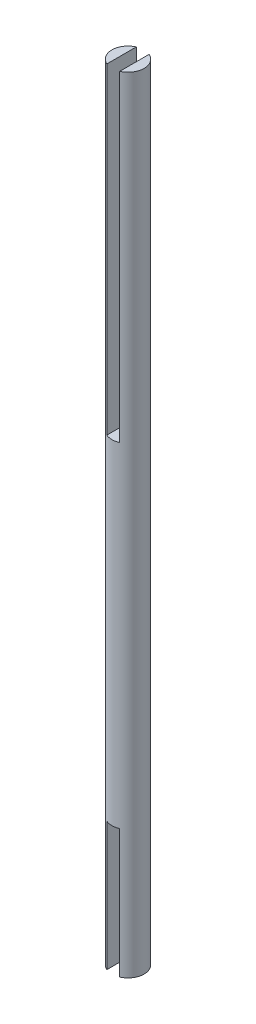
ISO-10303-21;
HEADER;
FILE_DESCRIPTION(('STEP AP214'),'2;1');
FILE_NAME('part.step','',(''),(''),'','','');
FILE_SCHEMA(('AUTOMOTIVE_DESIGN { 1 0 10303 214 1 1 1 1 }'));
ENDSEC;
DATA;
#1=APPLICATION_CONTEXT('core data for automotive mechanical design processes');
#2=APPLICATION_PROTOCOL_DEFINITION('international standard','automotive_design',2000,#1);
#3=PRODUCT_CONTEXT('',#1,'mechanical');
#4=PRODUCT('Part','Part','',(#3));
#5=PRODUCT_RELATED_PRODUCT_CATEGORY('part','',(#4));
#6=PRODUCT_DEFINITION_FORMATION('','',#4);
#7=PRODUCT_DEFINITION_CONTEXT('part definition',#1,'design');
#8=PRODUCT_DEFINITION('design','',#6,#7);
#9=PRODUCT_DEFINITION_SHAPE('','',#8);
#10=(LENGTH_UNIT() NAMED_UNIT(*) SI_UNIT(.MILLI.,.METRE.));
#11=(NAMED_UNIT(*) PLANE_ANGLE_UNIT() SI_UNIT($,.RADIAN.));
#12=(NAMED_UNIT(*) SI_UNIT($,.STERADIAN.) SOLID_ANGLE_UNIT());
#13=UNCERTAINTY_MEASURE_WITH_UNIT(LENGTH_MEASURE(1.E-05),#10,'distance_accuracy_value','');
#14=(GEOMETRIC_REPRESENTATION_CONTEXT(3) GLOBAL_UNCERTAINTY_ASSIGNED_CONTEXT((#13)) GLOBAL_UNIT_ASSIGNED_CONTEXT((#10,
#11,#12)) REPRESENTATION_CONTEXT('',''));
#15=CARTESIAN_POINT('',(0.,0.,0.));
#16=DIRECTION('',(0.,0.,1.));
#17=DIRECTION('',(1.,0.,0.));
#18=AXIS2_PLACEMENT_3D('',#15,#16,#17);
#19=CARTESIAN_POINT('',(0.,104.,0.));
#20=DIRECTION('',(0.,1.,0.));
#21=DIRECTION('',(0.,0.,1.));
#22=AXIS2_PLACEMENT_3D('',#19,#20,#21);
#23=PLANE('',#22);
#24=CARTESIAN_POINT('',(0.,104.,0.));
#25=DIRECTION('',(0.,1.,0.));
#26=DIRECTION('',(0.,0.,1.));
#27=AXIS2_PLACEMENT_3D('',#24,#25,#26);
#28=CIRCLE('',#27,5.);
#29=CARTESIAN_POINT('',(-2.,104.,4.58257569495584));
#30=VERTEX_POINT('',#29);
#31=CARTESIAN_POINT('',(2.,104.,4.58257569495584));
#32=VERTEX_POINT('',#31);
#33=EDGE_CURVE('E11',#30,#32,#28,.T.);
#34=ORIENTED_EDGE('',*,*,#33,.T.);
#35=DIRECTION('',(0.,0.,1.));
#36=VECTOR('',#35,1.);
#37=CARTESIAN_POINT('',(2.,104.,-4.58257569495584));
#38=LINE('',#37,#36);
#39=CARTESIAN_POINT('',(2.,104.,-4.58257569495584));
#40=VERTEX_POINT('',#39);
#41=EDGE_CURVE('E134',#40,#32,#38,.T.);
#42=ORIENTED_EDGE('',*,*,#41,.F.);
#43=CARTESIAN_POINT('',(-2.,104.,-4.58257569495584));
#44=VERTEX_POINT('',#43);
#45=EDGE_CURVE('E43',#40,#44,#28,.T.);
#46=ORIENTED_EDGE('',*,*,#45,.T.);
#47=DIRECTION('',(0.,0.,-1.));
#48=VECTOR('',#47,1.);
#49=CARTESIAN_POINT('',(-2.,104.,-4.58257569495584));
#50=LINE('',#49,#48);
#51=EDGE_CURVE('E169',#30,#44,#50,.T.);
#52=ORIENTED_EDGE('',*,*,#51,.F.);
#53=EDGE_LOOP('',(#34,#42,#46,#52));
#54=FACE_BOUND('',#53,.T.);
#55=ADVANCED_FACE('F33',(#54),#23,.T.);
#56=CARTESIAN_POINT('',(0.,104.,0.));
#57=DIRECTION('',(0.,-1.,0.));
#58=DIRECTION('',(0.,0.,-1.));
#59=AXIS2_PLACEMENT_3D('',#56,#57,#58);
#60=CYLINDRICAL_SURFACE('',#59,5.);
#61=ORIENTED_EDGE('',*,*,#33,.F.);
#62=DIRECTION('',(0.,-1.,0.));
#63=VECTOR('',#62,1.);
#64=CARTESIAN_POINT('',(-2.,204.,4.58257569495584));
#65=LINE('',#64,#63);
#66=CARTESIAN_POINT('',(-2.,204.,4.58257569495584));
#67=VERTEX_POINT('',#66);
#68=EDGE_CURVE('E147',#67,#30,#65,.T.);
#69=ORIENTED_EDGE('',*,*,#68,.F.);
#70=CARTESIAN_POINT('',(0.,204.,0.));
#71=DIRECTION('',(0.,1.,0.));
#72=DIRECTION('',(0.,0.,1.));
#73=AXIS2_PLACEMENT_3D('',#70,#71,#72);
#74=CIRCLE('',#73,5.);
#75=CARTESIAN_POINT('',(-2.,204.,-4.58257569495584));
#76=VERTEX_POINT('',#75);
#77=EDGE_CURVE('E170',#76,#67,#74,.T.);
#78=ORIENTED_EDGE('',*,*,#77,.F.);
#79=DIRECTION('',(0.,-1.,0.));
#80=VECTOR('',#79,1.);
#81=CARTESIAN_POINT('',(-2.,204.,-4.58257569495584));
#82=LINE('',#81,#80);
#83=EDGE_CURVE('E149',#76,#44,#82,.T.);
#84=ORIENTED_EDGE('',*,*,#83,.T.);
#85=ORIENTED_EDGE('',*,*,#45,.F.);
#86=DIRECTION('',(0.,-1.,0.));
#87=VECTOR('',#86,1.);
#88=CARTESIAN_POINT('',(2.,204.,-4.58257569495584));
#89=LINE('',#88,#87);
#90=CARTESIAN_POINT('',(2.,204.,-4.58257569495584));
#91=VERTEX_POINT('',#90);
#92=EDGE_CURVE('E171',#91,#40,#89,.T.);
#93=ORIENTED_EDGE('',*,*,#92,.F.);
#94=CARTESIAN_POINT('',(0.,204.,0.));
#95=DIRECTION('',(0.,1.,0.));
#96=DIRECTION('',(0.,0.,1.));
#97=AXIS2_PLACEMENT_3D('',#94,#95,#96);
#98=CIRCLE('',#97,5.);
#99=CARTESIAN_POINT('',(2.,204.,4.58257569495584));
#100=VERTEX_POINT('',#99);
#101=EDGE_CURVE('E125',#100,#91,#98,.T.);
#102=ORIENTED_EDGE('',*,*,#101,.F.);
#103=DIRECTION('',(0.,-1.,0.));
#104=VECTOR('',#103,1.);
#105=CARTESIAN_POINT('',(2.,204.,4.58257569495584));
#106=LINE('',#105,#104);
#107=EDGE_CURVE('E175',#100,#32,#106,.T.);
#108=ORIENTED_EDGE('',*,*,#107,.T.);
#109=EDGE_LOOP('',(#61,#69,#78,#84,#85,#93,#102,#108));
#110=FACE_BOUND('',#109,.T.);
#111=CARTESIAN_POINT('',(0.,0.,0.));
#112=DIRECTION('',(0.,1.,0.));
#113=DIRECTION('',(0.,0.,1.));
#114=AXIS2_PLACEMENT_3D('',#111,#112,#113);
#115=CIRCLE('',#114,5.);
#116=CARTESIAN_POINT('',(-2.,0.,4.58257569495584));
#117=VERTEX_POINT('',#116);
#118=CARTESIAN_POINT('',(2.,0.,4.58257569495584));
#119=VERTEX_POINT('',#118);
#120=EDGE_CURVE('E131',#117,#119,#115,.T.);
#121=ORIENTED_EDGE('',*,*,#120,.T.);
#122=DIRECTION('',(0.,1.,0.));
#123=VECTOR('',#122,1.);
#124=CARTESIAN_POINT('',(2.,-40.,4.58257569495584));
#125=LINE('',#124,#123);
#126=CARTESIAN_POINT('',(2.,-40.,4.58257569495584));
#127=VERTEX_POINT('',#126);
#128=EDGE_CURVE('E51',#127,#119,#125,.T.);
#129=ORIENTED_EDGE('',*,*,#128,.F.);
#130=CARTESIAN_POINT('',(0.,-40.,0.));
#131=DIRECTION('',(0.,1.,0.));
#132=DIRECTION('',(0.,0.,1.));
#133=AXIS2_PLACEMENT_3D('',#130,#131,#132);
#134=CIRCLE('',#133,5.);
#135=CARTESIAN_POINT('',(2.,-40.,-4.58257569495584));
#136=VERTEX_POINT('',#135);
#137=EDGE_CURVE('E106',#127,#136,#134,.T.);
#138=ORIENTED_EDGE('',*,*,#137,.T.);
#139=DIRECTION('',(0.,1.,0.));
#140=VECTOR('',#139,1.);
#141=CARTESIAN_POINT('',(2.,-40.,-4.58257569495584));
#142=LINE('',#141,#140);
#143=CARTESIAN_POINT('',(2.,0.,-4.58257569495584));
#144=VERTEX_POINT('',#143);
#145=EDGE_CURVE('E98',#136,#144,#142,.T.);
#146=ORIENTED_EDGE('',*,*,#145,.T.);
#147=CARTESIAN_POINT('',(-2.,0.,-4.58257569495584));
#148=VERTEX_POINT('',#147);
#149=EDGE_CURVE('E37',#144,#148,#115,.T.);
#150=ORIENTED_EDGE('',*,*,#149,.T.);
#151=DIRECTION('',(0.,1.,0.));
#152=VECTOR('',#151,1.);
#153=CARTESIAN_POINT('',(-2.,-40.,-4.58257569495584));
#154=LINE('',#153,#152);
#155=CARTESIAN_POINT('',(-2.,-40.,-4.58257569495584));
#156=VERTEX_POINT('',#155);
#157=EDGE_CURVE('E132',#156,#148,#154,.T.);
#158=ORIENTED_EDGE('',*,*,#157,.F.);
#159=CARTESIAN_POINT('',(0.,-40.,0.));
#160=DIRECTION('',(0.,1.,0.));
#161=DIRECTION('',(0.,0.,1.));
#162=AXIS2_PLACEMENT_3D('',#159,#160,#161);
#163=CIRCLE('',#162,5.);
#164=CARTESIAN_POINT('',(-2.,-40.,4.58257569495584));
#165=VERTEX_POINT('',#164);
#166=EDGE_CURVE('E116',#156,#165,#163,.T.);
#167=ORIENTED_EDGE('',*,*,#166,.T.);
#168=DIRECTION('',(0.,1.,0.));
#169=VECTOR('',#168,1.);
#170=CARTESIAN_POINT('',(-2.,-40.,4.58257569495584));
#171=LINE('',#170,#169);
#172=EDGE_CURVE('E122',#165,#117,#171,.T.);
#173=ORIENTED_EDGE('',*,*,#172,.T.);
#174=EDGE_LOOP('',(#121,#129,#138,#146,#150,#158,#167,#173));
#175=FACE_BOUND('',#174,.T.);
#176=ADVANCED_FACE('F35',(#110,#175),#60,.T.);
#177=CARTESIAN_POINT('',(0.,0.,0.));
#178=DIRECTION('',(0.,1.,0.));
#179=DIRECTION('',(0.,0.,1.));
#180=AXIS2_PLACEMENT_3D('',#177,#178,#179);
#181=PLANE('',#180);
#182=ORIENTED_EDGE('',*,*,#149,.F.);
#183=DIRECTION('',(0.,0.,1.));
#184=VECTOR('',#183,1.);
#185=CARTESIAN_POINT('',(2.,0.,0.));
#186=LINE('',#185,#184);
#187=EDGE_CURVE('E103',#144,#119,#186,.T.);
#188=ORIENTED_EDGE('',*,*,#187,.T.);
#189=ORIENTED_EDGE('',*,*,#120,.F.);
#190=DIRECTION('',(0.,0.,-1.));
#191=VECTOR('',#190,1.);
#192=CARTESIAN_POINT('',(-2.,0.,0.));
#193=LINE('',#192,#191);
#194=EDGE_CURVE('E114',#117,#148,#193,.T.);
#195=ORIENTED_EDGE('',*,*,#194,.T.);
#196=EDGE_LOOP('',(#182,#188,#189,#195));
#197=FACE_BOUND('',#196,.T.);
#198=ADVANCED_FACE('F145',(#197),#181,.F.);
#199=CARTESIAN_POINT('',(-2.,204.,-4.58257569495584));
#200=DIRECTION('',(-1.,0.,0.));
#201=DIRECTION('',(0.,0.,1.));
#202=AXIS2_PLACEMENT_3D('',#199,#200,#201);
#203=PLANE('',#202);
#204=ORIENTED_EDGE('',*,*,#51,.T.);
#205=ORIENTED_EDGE('',*,*,#83,.F.);
#206=DIRECTION('',(0.,0.,-1.));
#207=VECTOR('',#206,1.);
#208=CARTESIAN_POINT('',(-2.,204.,-4.58257569495584));
#209=LINE('',#208,#207);
#210=EDGE_CURVE('E155',#67,#76,#209,.T.);
#211=ORIENTED_EDGE('',*,*,#210,.F.);
#212=ORIENTED_EDGE('',*,*,#68,.T.);
#213=EDGE_LOOP('',(#204,#205,#211,#212));
#214=FACE_BOUND('',#213,.T.);
#215=ADVANCED_FACE('F187',(#214),#203,.F.);
#216=CARTESIAN_POINT('',(0.,204.,0.));
#217=DIRECTION('',(0.,1.,0.));
#218=DIRECTION('',(0.,0.,1.));
#219=AXIS2_PLACEMENT_3D('',#216,#217,#218);
#220=PLANE('',#219);
#221=ORIENTED_EDGE('',*,*,#77,.T.);
#222=ORIENTED_EDGE('',*,*,#210,.T.);
#223=EDGE_LOOP('',(#221,#222));
#224=FACE_BOUND('',#223,.T.);
#225=ADVANCED_FACE('F185',(#224),#220,.T.);
#226=CARTESIAN_POINT('',(2.,204.,-4.58257569495584));
#227=DIRECTION('',(1.,0.,0.));
#228=DIRECTION('',(0.,0.,-1.));
#229=AXIS2_PLACEMENT_3D('',#226,#227,#228);
#230=PLANE('',#229);
#231=ORIENTED_EDGE('',*,*,#41,.T.);
#232=ORIENTED_EDGE('',*,*,#107,.F.);
#233=DIRECTION('',(0.,0.,1.));
#234=VECTOR('',#233,1.);
#235=CARTESIAN_POINT('',(2.,204.,-4.58257569495584));
#236=LINE('',#235,#234);
#237=EDGE_CURVE('E181',#91,#100,#236,.T.);
#238=ORIENTED_EDGE('',*,*,#237,.F.);
#239=ORIENTED_EDGE('',*,*,#92,.T.);
#240=EDGE_LOOP('',(#231,#232,#238,#239));
#241=FACE_BOUND('',#240,.T.);
#242=ADVANCED_FACE('F196',(#241),#230,.F.);
#243=CARTESIAN_POINT('',(0.,204.,0.));
#244=DIRECTION('',(0.,1.,0.));
#245=DIRECTION('',(0.,0.,1.));
#246=AXIS2_PLACEMENT_3D('',#243,#244,#245);
#247=PLANE('',#246);
#248=ORIENTED_EDGE('',*,*,#101,.T.);
#249=ORIENTED_EDGE('',*,*,#237,.T.);
#250=EDGE_LOOP('',(#248,#249));
#251=FACE_BOUND('',#250,.T.);
#252=ADVANCED_FACE('F197',(#251),#247,.T.);
#253=CARTESIAN_POINT('',(-2.,-40.,0.));
#254=DIRECTION('',(1.,0.,0.));
#255=DIRECTION('',(0.,0.,-1.));
#256=AXIS2_PLACEMENT_3D('',#253,#254,#255);
#257=PLANE('',#256);
#258=ORIENTED_EDGE('',*,*,#194,.F.);
#259=ORIENTED_EDGE('',*,*,#172,.F.);
#260=DIRECTION('',(0.,0.,-1.));
#261=VECTOR('',#260,1.);
#262=CARTESIAN_POINT('',(-2.,-40.,0.));
#263=LINE('',#262,#261);
#264=EDGE_CURVE('E119',#165,#156,#263,.T.);
#265=ORIENTED_EDGE('',*,*,#264,.T.);
#266=ORIENTED_EDGE('',*,*,#157,.T.);
#267=EDGE_LOOP('',(#258,#259,#265,#266));
#268=FACE_BOUND('',#267,.T.);
#269=ADVANCED_FACE('F143',(#268),#257,.T.);
#270=CARTESIAN_POINT('',(0.,-40.,0.));
#271=DIRECTION('',(0.,1.,0.));
#272=DIRECTION('',(0.,0.,1.));
#273=AXIS2_PLACEMENT_3D('',#270,#271,#272);
#274=PLANE('',#273);
#275=ORIENTED_EDGE('',*,*,#166,.F.);
#276=ORIENTED_EDGE('',*,*,#264,.F.);
#277=EDGE_LOOP('',(#275,#276));
#278=FACE_BOUND('',#277,.T.);
#279=ADVANCED_FACE('F204',(#278),#274,.F.);
#280=CARTESIAN_POINT('',(2.,-40.,0.));
#281=DIRECTION('',(-1.,0.,0.));
#282=DIRECTION('',(0.,0.,1.));
#283=AXIS2_PLACEMENT_3D('',#280,#281,#282);
#284=PLANE('',#283);
#285=ORIENTED_EDGE('',*,*,#187,.F.);
#286=ORIENTED_EDGE('',*,*,#145,.F.);
#287=DIRECTION('',(0.,0.,1.));
#288=VECTOR('',#287,1.);
#289=CARTESIAN_POINT('',(2.,-40.,0.));
#290=LINE('',#289,#288);
#291=EDGE_CURVE('E102',#136,#127,#290,.T.);
#292=ORIENTED_EDGE('',*,*,#291,.T.);
#293=ORIENTED_EDGE('',*,*,#128,.T.);
#294=EDGE_LOOP('',(#285,#286,#292,#293));
#295=FACE_BOUND('',#294,.T.);
#296=ADVANCED_FACE('F100',(#295),#284,.T.);
#297=CARTESIAN_POINT('',(0.,-40.,0.));
#298=DIRECTION('',(0.,1.,0.));
#299=DIRECTION('',(0.,0.,1.));
#300=AXIS2_PLACEMENT_3D('',#297,#298,#299);
#301=PLANE('',#300);
#302=ORIENTED_EDGE('',*,*,#137,.F.);
#303=ORIENTED_EDGE('',*,*,#291,.F.);
#304=EDGE_LOOP('',(#302,#303));
#305=FACE_BOUND('',#304,.T.);
#306=ADVANCED_FACE('F110',(#305),#301,.F.);
#307=CLOSED_SHELL('',(#55,#176,#198,#215,#225,#242,#252,#269,#279,#296,#306));
#308=MANIFOLD_SOLID_BREP('B2',#307);
#309=ADVANCED_BREP_SHAPE_REPRESENTATION('',(#18,#308),#14);
#310=SHAPE_DEFINITION_REPRESENTATION(#9,#309);
ENDSEC;
END-ISO-10303-21;
